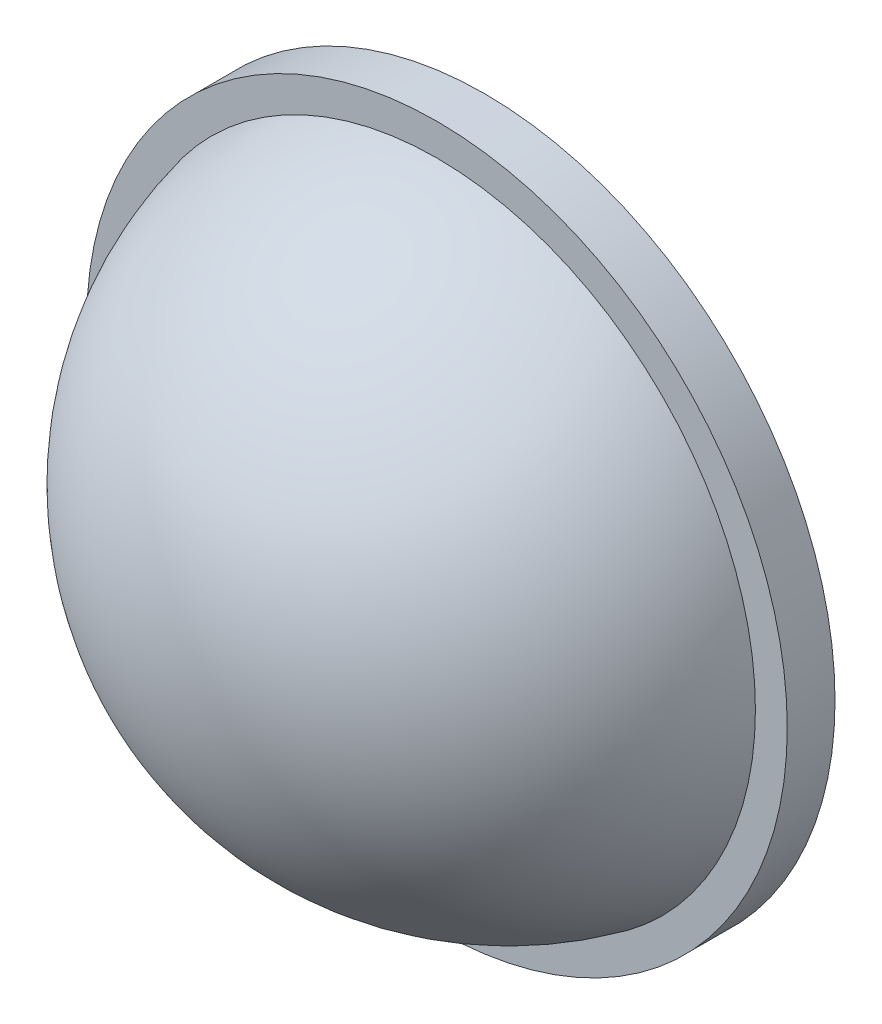
ISO-10303-21;
HEADER;
FILE_DESCRIPTION(('STEP AP214'),'2;1');
FILE_NAME('part.step','',(''),(''),'','','');
FILE_SCHEMA(('AUTOMOTIVE_DESIGN { 1 0 10303 214 1 1 1 1 }'));
ENDSEC;
DATA;
#1=APPLICATION_CONTEXT('core data for automotive mechanical design processes');
#2=APPLICATION_PROTOCOL_DEFINITION('international standard','automotive_design',2000,#1);
#3=PRODUCT_CONTEXT('',#1,'mechanical');
#4=PRODUCT('Part','Part','',(#3));
#5=PRODUCT_RELATED_PRODUCT_CATEGORY('part','',(#4));
#6=PRODUCT_DEFINITION_FORMATION('','',#4);
#7=PRODUCT_DEFINITION_CONTEXT('part definition',#1,'design');
#8=PRODUCT_DEFINITION('design','',#6,#7);
#9=PRODUCT_DEFINITION_SHAPE('','',#8);
#10=(LENGTH_UNIT() NAMED_UNIT(*) SI_UNIT(.MILLI.,.METRE.));
#11=(NAMED_UNIT(*) PLANE_ANGLE_UNIT() SI_UNIT($,.RADIAN.));
#12=(NAMED_UNIT(*) SI_UNIT($,.STERADIAN.) SOLID_ANGLE_UNIT());
#13=UNCERTAINTY_MEASURE_WITH_UNIT(LENGTH_MEASURE(1.E-05),#10,'distance_accuracy_value','');
#14=(GEOMETRIC_REPRESENTATION_CONTEXT(3) GLOBAL_UNCERTAINTY_ASSIGNED_CONTEXT((#13)) GLOBAL_UNIT_ASSIGNED_CONTEXT((#10,
#11,#12)) REPRESENTATION_CONTEXT('',''));
#15=CARTESIAN_POINT('',(0.,0.,0.));
#16=DIRECTION('',(0.,0.,1.));
#17=DIRECTION('',(1.,0.,0.));
#18=AXIS2_PLACEMENT_3D('',#15,#16,#17);
#19=CARTESIAN_POINT('',(0.,0.,-1.5));
#20=DIRECTION('',(0.,0.,1.));
#21=DIRECTION('',(1.,0.,0.));
#22=AXIS2_PLACEMENT_3D('',#19,#20,#21);
#23=SPHERICAL_SURFACE('',#22,20.5);
#24=CARTESIAN_POINT('',(0.,0.,3.00000004470348));
#25=DIRECTION('',(0.,0.,1.));
#26=DIRECTION('',(1.,0.,0.));
#27=AXIS2_PLACEMENT_3D('',#24,#25,#26);
#28=CIRCLE('',#27,20.0000002980232);
#29=CARTESIAN_POINT('',(-20.0000002980232,0.,3.00000004470348));
#30=VERTEX_POINT('',#29);
#31=EDGE_CURVE('E26',#30,#30,#28,.T.);
#32=ORIENTED_EDGE('',*,*,#31,.T.);
#33=CARTESIAN_POINT('',(0.,0.,-1.5));
#34=DIRECTION('',(0.,-1.,0.));
#35=DIRECTION('',(-1.,0.,0.));
#36=AXIS2_PLACEMENT_3D('',#33,#34,#35);
#37=CIRCLE('',#36,20.5);
#38=CARTESIAN_POINT('',(0.,0.,19.));
#39=VERTEX_POINT('',#38);
#40=EDGE_CURVE('E10',#39,#30,#37,.T.);
#41=ORIENTED_EDGE('',*,*,#40,.F.);
#42=ORIENTED_EDGE('',*,*,#40,.T.);
#43=EDGE_LOOP('',(#32,#41,#42));
#44=FACE_BOUND('',#43,.T.);
#45=ADVANCED_FACE('F15',(#44),#23,.T.);
#46=CARTESIAN_POINT('',(20.0000002980232,0.,3.00000004470348));
#47=DIRECTION('',(0.,0.,1.));
#48=DIRECTION('',(1.,0.,0.));
#49=AXIS2_PLACEMENT_3D('',#46,#47,#48);
#50=PLANE('',#49);
#51=ORIENTED_EDGE('',*,*,#31,.F.);
#52=EDGE_LOOP('',(#51));
#53=FACE_BOUND('',#52,.T.);
#54=CARTESIAN_POINT('',(0.,0.,3.00000004470348));
#55=DIRECTION('',(0.,0.,1.));
#56=DIRECTION('',(1.,0.,0.));
#57=AXIS2_PLACEMENT_3D('',#54,#55,#56);
#58=CIRCLE('',#57,22.);
#59=CARTESIAN_POINT('',(-22.,0.,3.00000004470348));
#60=VERTEX_POINT('',#59);
#61=EDGE_CURVE('E52',#60,#60,#58,.T.);
#62=ORIENTED_EDGE('',*,*,#61,.T.);
#63=EDGE_LOOP('',(#62));
#64=FACE_BOUND('',#63,.T.);
#65=ADVANCED_FACE('F17',(#53,#64),#50,.T.);
#66=CARTESIAN_POINT('',(0.,0.,1.50000002235174));
#67=DIRECTION('',(0.,0.,1.));
#68=DIRECTION('',(1.,0.,0.));
#69=AXIS2_PLACEMENT_3D('',#66,#67,#68);
#70=CYLINDRICAL_SURFACE('',#69,22.);
#71=ORIENTED_EDGE('',*,*,#61,.F.);
#72=DIRECTION('',(0.,0.,-1.));
#73=VECTOR('',#72,1.);
#74=CARTESIAN_POINT('',(-22.,0.,1.50000002235174));
#75=LINE('',#74,#73);
#76=CARTESIAN_POINT('',(-22.,0.,0.));
#77=VERTEX_POINT('',#76);
#78=EDGE_CURVE('E19',#60,#77,#75,.T.);
#79=ORIENTED_EDGE('',*,*,#78,.T.);
#80=CARTESIAN_POINT('',(0.,0.,0.));
#81=DIRECTION('',(0.,0.,1.));
#82=DIRECTION('',(1.,0.,0.));
#83=AXIS2_PLACEMENT_3D('',#80,#81,#82);
#84=CIRCLE('',#83,22.);
#85=EDGE_CURVE('E51',#77,#77,#84,.T.);
#86=ORIENTED_EDGE('',*,*,#85,.T.);
#87=ORIENTED_EDGE('',*,*,#78,.F.);
#88=EDGE_LOOP('',(#71,#79,#86,#87));
#89=FACE_BOUND('',#88,.T.);
#90=ADVANCED_FACE('F49',(#89),#70,.T.);
#91=CARTESIAN_POINT('',(22.,0.,0.));
#92=DIRECTION('',(0.,0.,-1.));
#93=DIRECTION('',(0.,-1.,0.));
#94=AXIS2_PLACEMENT_3D('',#91,#92,#93);
#95=PLANE('',#94);
#96=ORIENTED_EDGE('',*,*,#85,.F.);
#97=EDGE_LOOP('',(#96));
#98=FACE_BOUND('',#97,.T.);
#99=ADVANCED_FACE('F82',(#98),#95,.T.);
#100=CLOSED_SHELL('',(#45,#65,#90,#99));
#101=MANIFOLD_SOLID_BREP('B1',#100);
#102=ADVANCED_BREP_SHAPE_REPRESENTATION('',(#18,#101),#14);
#103=SHAPE_DEFINITION_REPRESENTATION(#9,#102);
ENDSEC;
END-ISO-10303-21;
